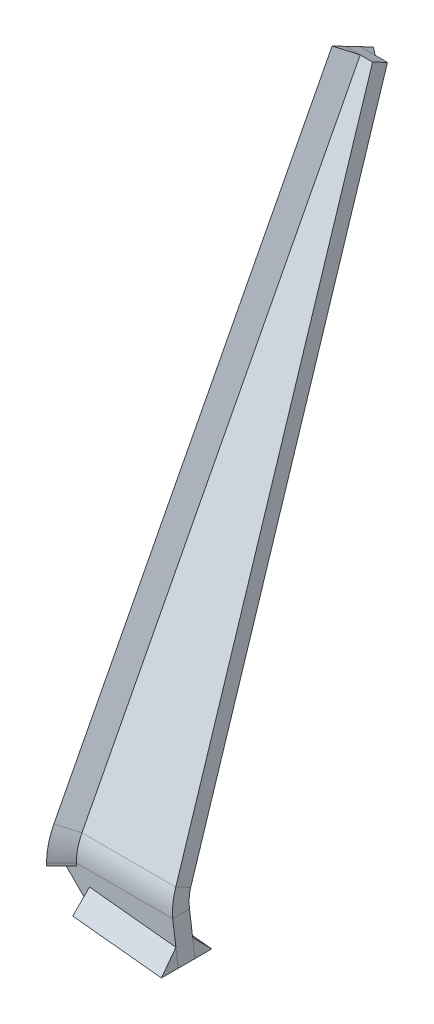
ISO-10303-21;
HEADER;
FILE_DESCRIPTION(('STEP AP214'),'2;1');
FILE_NAME('part.step','',(''),(''),'','','');
FILE_SCHEMA(('AUTOMOTIVE_DESIGN { 1 0 10303 214 1 1 1 1 }'));
ENDSEC;
DATA;
#1=APPLICATION_CONTEXT('core data for automotive mechanical design processes');
#2=APPLICATION_PROTOCOL_DEFINITION('international standard','automotive_design',2000,#1);
#3=PRODUCT_CONTEXT('',#1,'mechanical');
#4=PRODUCT('Part','Part','',(#3));
#5=PRODUCT_RELATED_PRODUCT_CATEGORY('part','',(#4));
#6=PRODUCT_DEFINITION_FORMATION('','',#4);
#7=PRODUCT_DEFINITION_CONTEXT('part definition',#1,'design');
#8=PRODUCT_DEFINITION('design','',#6,#7);
#9=PRODUCT_DEFINITION_SHAPE('','',#8);
#10=(LENGTH_UNIT() NAMED_UNIT(*) SI_UNIT(.MILLI.,.METRE.));
#11=(NAMED_UNIT(*) PLANE_ANGLE_UNIT() SI_UNIT($,.RADIAN.));
#12=(NAMED_UNIT(*) SI_UNIT($,.STERADIAN.) SOLID_ANGLE_UNIT());
#13=UNCERTAINTY_MEASURE_WITH_UNIT(LENGTH_MEASURE(1.E-05),#10,'distance_accuracy_value','');
#14=(GEOMETRIC_REPRESENTATION_CONTEXT(3) GLOBAL_UNCERTAINTY_ASSIGNED_CONTEXT((#13)) GLOBAL_UNIT_ASSIGNED_CONTEXT((#10,
#11,#12)) REPRESENTATION_CONTEXT('',''));
#15=CARTESIAN_POINT('',(0.,0.,0.));
#16=DIRECTION('',(0.,0.,1.));
#17=DIRECTION('',(1.,0.,0.));
#18=AXIS2_PLACEMENT_3D('',#15,#16,#17);
#19=CARTESIAN_POINT('',(3.54804333271288,6.67696676559556,4.00000000000001));
#20=DIRECTION('',(0.,0.,1.));
#21=DIRECTION('',(1.,0.,0.));
#22=AXIS2_PLACEMENT_3D('',#19,#20,#21);
#23=PLANE('',#22);
#24=DIRECTION('',(-1.,0.,0.));
#25=VECTOR('',#24,1.);
#26=CARTESIAN_POINT('',(3.54804333271288,6.67696676559556,4.00000000000001));
#27=LINE('',#26,#25);
#28=CARTESIAN_POINT('',(3.54804333271288,6.67696676559556,4.00000000000001));
#29=VERTEX_POINT('',#28);
#30=CARTESIAN_POINT('',(0.,6.67696676559556,4.00000000000001));
#31=VERTEX_POINT('',#30);
#32=EDGE_CURVE('E130',#29,#31,#27,.T.);
#33=ORIENTED_EDGE('',*,*,#32,.F.);
#34=DIRECTION('',(0.,-1.,0.));
#35=VECTOR('',#34,1.);
#36=CARTESIAN_POINT('',(3.54804333271288,6.67696676559556,4.00000000000001));
#37=LINE('',#36,#35);
#38=CARTESIAN_POINT('',(3.54804333271288,6.00000000000009,4.00000000000001));
#39=VERTEX_POINT('',#38);
#40=EDGE_CURVE('E73',#29,#39,#37,.T.);
#41=ORIENTED_EDGE('',*,*,#40,.T.);
#42=DIRECTION('',(-1.,0.,0.));
#43=VECTOR('',#42,1.);
#44=CARTESIAN_POINT('',(3.54804333271288,6.00000000000009,4.00000000000001));
#45=LINE('',#44,#43);
#46=CARTESIAN_POINT('',(0.,6.00000000000009,4.00000000000001));
#47=VERTEX_POINT('',#46);
#48=EDGE_CURVE('E80',#39,#47,#45,.T.);
#49=ORIENTED_EDGE('',*,*,#48,.T.);
#50=DIRECTION('',(0.,-1.,0.));
#51=VECTOR('',#50,1.);
#52=CARTESIAN_POINT('',(0.,6.67696676559556,4.00000000000001));
#53=LINE('',#52,#51);
#54=EDGE_CURVE('E13',#31,#47,#53,.T.);
#55=ORIENTED_EDGE('',*,*,#54,.F.);
#56=EDGE_LOOP('',(#33,#41,#49,#55));
#57=FACE_BOUND('',#56,.T.);
#58=ADVANCED_FACE('F66',(#57),#23,.F.);
#59=CARTESIAN_POINT('',(0.,6.67696676559555,7.5480433327129));
#60=DIRECTION('',(-0.707106781186548,0.,-0.707106781186547));
#61=DIRECTION('',(-0.707106781186547,0.,0.707106781186548));
#62=AXIS2_PLACEMENT_3D('',#59,#60,#61);
#63=PLANE('',#62);
#64=DIRECTION('',(0.707106781186547,0.,-0.707106781186548));
#65=VECTOR('',#64,1.);
#66=CARTESIAN_POINT('',(0.,6.67696676559555,7.5480433327129));
#67=LINE('',#66,#65);
#68=CARTESIAN_POINT('',(0.,6.67696676559555,7.5480433327129));
#69=VERTEX_POINT('',#68);
#70=EDGE_CURVE('E153',#69,#29,#67,.T.);
#71=ORIENTED_EDGE('',*,*,#70,.F.);
#72=DIRECTION('',(0.,-1.,0.));
#73=VECTOR('',#72,1.);
#74=CARTESIAN_POINT('',(0.,6.67696676559555,7.5480433327129));
#75=LINE('',#74,#73);
#76=CARTESIAN_POINT('',(0.,6.00000000000008,7.5480433327129));
#77=VERTEX_POINT('',#76);
#78=EDGE_CURVE('E125',#69,#77,#75,.T.);
#79=ORIENTED_EDGE('',*,*,#78,.T.);
#80=DIRECTION('',(0.707106781186547,0.,-0.707106781186548));
#81=VECTOR('',#80,1.);
#82=CARTESIAN_POINT('',(0.,6.00000000000008,7.5480433327129));
#83=LINE('',#82,#81);
#84=EDGE_CURVE('E88',#77,#39,#83,.T.);
#85=ORIENTED_EDGE('',*,*,#84,.T.);
#86=ORIENTED_EDGE('',*,*,#40,.F.);
#87=EDGE_LOOP('',(#71,#79,#85,#86));
#88=FACE_BOUND('',#87,.T.);
#89=ADVANCED_FACE('F166',(#88),#63,.F.);
#90=CARTESIAN_POINT('',(0.,6.67696676559554,-8.));
#91=DIRECTION('',(1.,0.,0.));
#92=DIRECTION('',(0.,1.,0.));
#93=AXIS2_PLACEMENT_3D('',#90,#91,#92);
#94=CYLINDRICAL_SURFACE('',#93,12.);
#95=DIRECTION('',(-1.,0.,0.));
#96=VECTOR('',#95,1.);
#97=CARTESIAN_POINT('',(3.54804333271288,12.217950124416,2.64412999813864));
#98=LINE('',#97,#96);
#99=CARTESIAN_POINT('',(3.54804333271288,12.217950124416,2.64412999813864));
#100=VERTEX_POINT('',#99);
#101=CARTESIAN_POINT('',(0.,12.217950124416,2.64412999813864));
#102=VERTEX_POINT('',#101);
#103=EDGE_CURVE('E138',#100,#102,#98,.T.);
#104=ORIENTED_EDGE('',*,*,#103,.F.);
#105=CARTESIAN_POINT('',(3.54804333271288,6.67696676559554,-8.));
#106=DIRECTION('',(1.,0.,0.));
#107=DIRECTION('',(0.,1.,0.));
#108=AXIS2_PLACEMENT_3D('',#105,#106,#107);
#109=CIRCLE('',#108,12.);
#110=EDGE_CURVE('E129',#100,#29,#109,.T.);
#111=ORIENTED_EDGE('',*,*,#110,.T.);
#112=ORIENTED_EDGE('',*,*,#32,.T.);
#113=CARTESIAN_POINT('',(0.,6.67696676559554,-8.));
#114=DIRECTION('',(1.,0.,0.));
#115=DIRECTION('',(0.,1.,0.));
#116=AXIS2_PLACEMENT_3D('',#113,#114,#115);
#117=CIRCLE('',#116,12.);
#118=EDGE_CURVE('E158',#102,#31,#117,.T.);
#119=ORIENTED_EDGE('',*,*,#118,.F.);
#120=EDGE_LOOP('',(#104,#111,#112,#119));
#121=FACE_BOUND('',#120,.T.);
#122=ADVANCED_FACE('F168',(#121),#94,.F.);
#123=CARTESIAN_POINT('',(0.,6.67696676559554,-8.));
#124=DIRECTION('',(-1.,0.,0.));
#125=DIRECTION('',(0.,-1.,0.));
#126=AXIS2_PLACEMENT_3D('',#123,#124,#125);
#127=CONICAL_SURFACE('',#126,15.5480433327129,0.785398163397448);
#128=DIRECTION('',(0.707106781186547,-0.326505575621977,-0.62721137512625));
#129=VECTOR('',#128,1.);
#130=CARTESIAN_POINT('',(0.,13.856254212994,5.79128287084073));
#131=LINE('',#130,#129);
#132=CARTESIAN_POINT('',(0.,13.856254212994,5.79128287084073));
#133=VERTEX_POINT('',#132);
#134=EDGE_CURVE('E133',#133,#100,#131,.T.);
#135=ORIENTED_EDGE('',*,*,#134,.F.);
#136=CARTESIAN_POINT('',(0.,6.67696676559554,-8.));
#137=DIRECTION('',(1.,0.,0.));
#138=DIRECTION('',(0.,1.,0.));
#139=AXIS2_PLACEMENT_3D('',#136,#137,#138);
#140=CIRCLE('',#139,15.5480433327129);
#141=EDGE_CURVE('E118',#133,#69,#140,.T.);
#142=ORIENTED_EDGE('',*,*,#141,.T.);
#143=ORIENTED_EDGE('',*,*,#70,.T.);
#144=ORIENTED_EDGE('',*,*,#110,.F.);
#145=EDGE_LOOP('',(#135,#142,#143,#144));
#146=FACE_BOUND('',#145,.T.);
#147=ADVANCED_FACE('F134',(#146),#127,.T.);
#148=CARTESIAN_POINT('',(0.,12.217950124416,2.64412999813864));
#149=DIRECTION('',(-1.,0.,0.));
#150=DIRECTION('',(0.,0.,1.));
#151=AXIS2_PLACEMENT_3D('',#148,#149,#150);
#152=PLANE('',#151);
#153=DIRECTION('',(0.,0.461748613235034,0.887010833178221));
#154=VECTOR('',#153,1.);
#155=CARTESIAN_POINT('',(0.,139.660976123687,-63.6985101596913));
#156=LINE('',#155,#154);
#157=CARTESIAN_POINT('',(0.,139.660976123687,-63.6985101596913));
#158=VERTEX_POINT('',#157);
#159=CARTESIAN_POINT('',(0.,141.299280212264,-60.5513572869892));
#160=VERTEX_POINT('',#159);
#161=EDGE_CURVE('E177',#158,#160,#156,.T.);
#162=ORIENTED_EDGE('',*,*,#161,.F.);
#163=DIRECTION('',(0.,0.887010833178221,-0.461748613235035));
#164=VECTOR('',#163,1.);
#165=CARTESIAN_POINT('',(0.,12.217950124416,2.64412999813864));
#166=LINE('',#165,#164);
#167=EDGE_CURVE('E147',#102,#158,#166,.T.);
#168=ORIENTED_EDGE('',*,*,#167,.F.);
#169=ORIENTED_EDGE('',*,*,#118,.T.);
#170=ORIENTED_EDGE('',*,*,#54,.T.);
#171=DIRECTION('',(0.,0.,1.));
#172=VECTOR('',#171,1.);
#173=CARTESIAN_POINT('',(0.,6.00000000000009,4.00000000000001));
#174=LINE('',#173,#172);
#175=EDGE_CURVE('E161',#47,#77,#174,.T.);
#176=ORIENTED_EDGE('',*,*,#175,.T.);
#177=ORIENTED_EDGE('',*,*,#78,.F.);
#178=ORIENTED_EDGE('',*,*,#141,.F.);
#179=DIRECTION('',(0.,0.887010833178221,-0.461748613235035));
#180=VECTOR('',#179,1.);
#181=CARTESIAN_POINT('',(0.,13.856254212994,5.79128287084073));
#182=LINE('',#181,#180);
#183=EDGE_CURVE('E123',#133,#160,#182,.T.);
#184=ORIENTED_EDGE('',*,*,#183,.T.);
#185=EDGE_LOOP('',(#162,#168,#169,#170,#176,#177,#178,#184));
#186=FACE_BOUND('',#185,.T.);
#187=ADVANCED_FACE('F121',(#186),#152,.T.);
#188=CARTESIAN_POINT('',(3.54804333271288,12.217950124416,2.64412999813864));
#189=DIRECTION('',(0.,-0.461748613235035,-0.887010833178221));
#190=DIRECTION('',(0.,0.887010833178221,-0.461748613235035));
#191=AXIS2_PLACEMENT_3D('',#188,#189,#190);
#192=PLANE('',#191);
#193=DIRECTION('',(-1.,0.,0.));
#194=VECTOR('',#193,1.);
#195=CARTESIAN_POINT('',(3.54804333271288,139.660976123687,-63.6985101596913));
#196=LINE('',#195,#194);
#197=CARTESIAN_POINT('',(3.54804333271288,139.660976123687,-63.6985101596913));
#198=VERTEX_POINT('',#197);
#199=EDGE_CURVE('E139',#198,#158,#196,.T.);
#200=ORIENTED_EDGE('',*,*,#199,.F.);
#201=DIRECTION('',(0.,0.887010833178221,-0.461748613235035));
#202=VECTOR('',#201,1.);
#203=CARTESIAN_POINT('',(3.54804333271288,12.217950124416,2.64412999813864));
#204=LINE('',#203,#202);
#205=EDGE_CURVE('E145',#100,#198,#204,.T.);
#206=ORIENTED_EDGE('',*,*,#205,.F.);
#207=ORIENTED_EDGE('',*,*,#103,.T.);
#208=ORIENTED_EDGE('',*,*,#167,.T.);
#209=EDGE_LOOP('',(#200,#206,#207,#208));
#210=FACE_BOUND('',#209,.T.);
#211=ADVANCED_FACE('F173',(#210),#192,.T.);
#212=CARTESIAN_POINT('',(0.,13.856254212994,5.79128287084073));
#213=DIRECTION('',(0.707106781186548,0.326505575621977,0.627211375126249));
#214=DIRECTION('',(0.663578618400424,0.,-0.748106554711148));
#215=AXIS2_PLACEMENT_3D('',#212,#213,#214);
#216=PLANE('',#215);
#217=DIRECTION('',(0.707106781186547,-0.326505575621977,-0.62721137512625));
#218=VECTOR('',#217,1.);
#219=CARTESIAN_POINT('',(0.,141.299280212264,-60.5513572869892));
#220=LINE('',#219,#218);
#221=EDGE_CURVE('E143',#160,#198,#220,.T.);
#222=ORIENTED_EDGE('',*,*,#221,.F.);
#223=ORIENTED_EDGE('',*,*,#183,.F.);
#224=ORIENTED_EDGE('',*,*,#134,.T.);
#225=ORIENTED_EDGE('',*,*,#205,.T.);
#226=EDGE_LOOP('',(#222,#223,#224,#225));
#227=FACE_BOUND('',#226,.T.);
#228=ADVANCED_FACE('F141',(#227),#216,.T.);
#229=CARTESIAN_POINT('',(0.,6.00000000000009,4.00000000000001));
#230=DIRECTION('',(0.,-1.,0.));
#231=DIRECTION('',(0.,0.,-1.));
#232=AXIS2_PLACEMENT_3D('',#229,#230,#231);
#233=PLANE('',#232);
#234=ORIENTED_EDGE('',*,*,#175,.F.);
#235=ORIENTED_EDGE('',*,*,#48,.F.);
#236=ORIENTED_EDGE('',*,*,#84,.F.);
#237=EDGE_LOOP('',(#234,#235,#236));
#238=FACE_BOUND('',#237,.T.);
#239=ADVANCED_FACE('F182',(#238),#233,.T.);
#240=CARTESIAN_POINT('',(0.,139.660976123687,-63.6985101596913));
#241=DIRECTION('',(0.,-0.887010833178221,0.461748613235034));
#242=DIRECTION('',(0.,-0.461748613235034,-0.887010833178221));
#243=AXIS2_PLACEMENT_3D('',#240,#241,#242);
#244=PLANE('',#243);
#245=ORIENTED_EDGE('',*,*,#161,.T.);
#246=ORIENTED_EDGE('',*,*,#221,.T.);
#247=ORIENTED_EDGE('',*,*,#199,.T.);
#248=EDGE_LOOP('',(#245,#246,#247));
#249=FACE_BOUND('',#248,.T.);
#250=ADVANCED_FACE('F176',(#249),#244,.F.);
#251=CLOSED_SHELL('',(#58,#89,#122,#147,#187,#211,#228,#239,#250));
#252=MANIFOLD_SOLID_BREP('B2',#251);
#253=CARTESIAN_POINT('',(3.54804333271288,6.67696676559557,0.));
#254=DIRECTION('',(0.,0.,-1.));
#255=DIRECTION('',(-1.,0.,0.));
#256=AXIS2_PLACEMENT_3D('',#253,#254,#255);
#257=PLANE('',#256);
#258=DIRECTION('',(1.,0.,0.));
#259=VECTOR('',#258,1.);
#260=CARTESIAN_POINT('',(3.54804333271288,6.67696676559557,0.));
#261=LINE('',#260,#259);
#262=CARTESIAN_POINT('',(0.,6.67696676559557,0.));
#263=VERTEX_POINT('',#262);
#264=CARTESIAN_POINT('',(3.54804333271288,6.67696676559557,0.));
#265=VERTEX_POINT('',#264);
#266=EDGE_CURVE('E337',#263,#265,#261,.T.);
#267=ORIENTED_EDGE('',*,*,#266,.F.);
#268=DIRECTION('',(0.,-1.,0.));
#269=VECTOR('',#268,1.);
#270=CARTESIAN_POINT('',(0.,6.67696676559557,0.));
#271=LINE('',#270,#269);
#272=CARTESIAN_POINT('',(0.,6.0000000000001,0.));
#273=VERTEX_POINT('',#272);
#274=EDGE_CURVE('E280',#263,#273,#271,.T.);
#275=ORIENTED_EDGE('',*,*,#274,.T.);
#276=DIRECTION('',(1.,0.,0.));
#277=VECTOR('',#276,1.);
#278=CARTESIAN_POINT('',(3.54804333271288,6.0000000000001,0.));
#279=LINE('',#278,#277);
#280=CARTESIAN_POINT('',(3.54804333271288,6.0000000000001,0.));
#281=VERTEX_POINT('',#280);
#282=EDGE_CURVE('E287',#273,#281,#279,.T.);
#283=ORIENTED_EDGE('',*,*,#282,.T.);
#284=DIRECTION('',(0.,-1.,0.));
#285=VECTOR('',#284,1.);
#286=CARTESIAN_POINT('',(3.54804333271288,6.67696676559557,0.));
#287=LINE('',#286,#285);
#288=EDGE_CURVE('E64',#265,#281,#287,.T.);
#289=ORIENTED_EDGE('',*,*,#288,.F.);
#290=EDGE_LOOP('',(#267,#275,#283,#289));
#291=FACE_BOUND('',#290,.T.);
#292=ADVANCED_FACE('F273',(#291),#257,.F.);
#293=CARTESIAN_POINT('',(0.,6.67696676559558,-3.5480433327129));
#294=DIRECTION('',(-0.707106781186548,0.,0.707106781186547));
#295=DIRECTION('',(0.707106781186547,0.,0.707106781186548));
#296=AXIS2_PLACEMENT_3D('',#293,#294,#295);
#297=PLANE('',#296);
#298=DIRECTION('',(-0.707106781186547,0.,-0.707106781186548));
#299=VECTOR('',#298,1.);
#300=CARTESIAN_POINT('',(0.,6.67696676559558,-3.5480433327129));
#301=LINE('',#300,#299);
#302=CARTESIAN_POINT('',(0.,6.67696676559558,-3.5480433327129));
#303=VERTEX_POINT('',#302);
#304=EDGE_CURVE('E335',#265,#303,#301,.T.);
#305=ORIENTED_EDGE('',*,*,#304,.F.);
#306=ORIENTED_EDGE('',*,*,#288,.T.);
#307=DIRECTION('',(-0.707106781186547,0.,-0.707106781186548));
#308=VECTOR('',#307,1.);
#309=CARTESIAN_POINT('',(0.,6.00000000000011,-3.5480433327129));
#310=LINE('',#309,#308);
#311=CARTESIAN_POINT('',(0.,6.00000000000011,-3.5480433327129));
#312=VERTEX_POINT('',#311);
#313=EDGE_CURVE('E371',#281,#312,#310,.T.);
#314=ORIENTED_EDGE('',*,*,#313,.T.);
#315=DIRECTION('',(0.,-1.,0.));
#316=VECTOR('',#315,1.);
#317=CARTESIAN_POINT('',(0.,6.67696676559558,-3.5480433327129));
#318=LINE('',#317,#316);
#319=EDGE_CURVE('E375',#303,#312,#318,.T.);
#320=ORIENTED_EDGE('',*,*,#319,.F.);
#321=EDGE_LOOP('',(#305,#306,#314,#320));
#322=FACE_BOUND('',#321,.T.);
#323=ADVANCED_FACE('F396',(#322),#297,.F.);
#324=CARTESIAN_POINT('',(0.,6.67696676559554,-8.));
#325=DIRECTION('',(1.,0.,0.));
#326=DIRECTION('',(0.,1.,0.));
#327=AXIS2_PLACEMENT_3D('',#324,#325,#326);
#328=CYLINDRICAL_SURFACE('',#327,7.99999999999999);
#329=DIRECTION('',(1.,0.,0.));
#330=VECTOR('',#329,1.);
#331=CARTESIAN_POINT('',(3.54804333271288,10.3709556714759,-0.903913334574263));
#332=LINE('',#331,#330);
#333=CARTESIAN_POINT('',(0.,10.3709556714759,-0.903913334574263));
#334=VERTEX_POINT('',#333);
#335=CARTESIAN_POINT('',(3.54804333271288,10.3709556714759,-0.903913334574263));
#336=VERTEX_POINT('',#335);
#337=EDGE_CURVE('E348',#334,#336,#332,.T.);
#338=ORIENTED_EDGE('',*,*,#337,.F.);
#339=CARTESIAN_POINT('',(0.,6.67696676559554,-8.));
#340=DIRECTION('',(1.,0.,0.));
#341=DIRECTION('',(0.,1.,0.));
#342=AXIS2_PLACEMENT_3D('',#339,#340,#341);
#343=CIRCLE('',#342,7.99999999999999);
#344=EDGE_CURVE('E336',#334,#263,#343,.T.);
#345=ORIENTED_EDGE('',*,*,#344,.T.);
#346=ORIENTED_EDGE('',*,*,#266,.T.);
#347=CARTESIAN_POINT('',(3.54804333271288,6.67696676559554,-8.));
#348=DIRECTION('',(1.,0.,0.));
#349=DIRECTION('',(0.,1.,0.));
#350=AXIS2_PLACEMENT_3D('',#347,#348,#349);
#351=CIRCLE('',#350,7.99999999999999);
#352=EDGE_CURVE('E369',#336,#265,#351,.T.);
#353=ORIENTED_EDGE('',*,*,#352,.F.);
#354=EDGE_LOOP('',(#338,#345,#346,#353));
#355=FACE_BOUND('',#354,.T.);
#356=ADVANCED_FACE('F380',(#355),#328,.T.);
#357=CARTESIAN_POINT('',(3.54804333271288,6.67696676559554,-8.));
#358=DIRECTION('',(1.,0.,0.));
#359=DIRECTION('',(0.,1.,0.));
#360=AXIS2_PLACEMENT_3D('',#357,#358,#359);
#361=CONICAL_SURFACE('',#360,7.99999999999999,0.785398163397449);
#362=DIRECTION('',(-0.707106781186547,-0.326505575621977,-0.62721137512625));
#363=VECTOR('',#362,1.);
#364=CARTESIAN_POINT('',(0.,8.73265158289788,-4.05106620727635));
#365=LINE('',#364,#363);
#366=CARTESIAN_POINT('',(0.,8.73265158289788,-4.05106620727635));
#367=VERTEX_POINT('',#366);
#368=EDGE_CURVE('E332',#336,#367,#365,.T.);
#369=ORIENTED_EDGE('',*,*,#368,.F.);
#370=ORIENTED_EDGE('',*,*,#352,.T.);
#371=ORIENTED_EDGE('',*,*,#304,.T.);
#372=CARTESIAN_POINT('',(0.,6.67696676559554,-8.));
#373=DIRECTION('',(1.,0.,0.));
#374=DIRECTION('',(0.,1.,0.));
#375=AXIS2_PLACEMENT_3D('',#372,#373,#374);
#376=CIRCLE('',#375,4.4519566672871);
#377=EDGE_CURVE('E327',#367,#303,#376,.T.);
#378=ORIENTED_EDGE('',*,*,#377,.F.);
#379=EDGE_LOOP('',(#369,#370,#371,#378));
#380=FACE_BOUND('',#379,.T.);
#381=ADVANCED_FACE('F329',(#380),#361,.F.);
#382=CARTESIAN_POINT('',(0.,8.73265158289788,-4.05106620727635));
#383=DIRECTION('',(0.707106781186548,-0.326505575621977,-0.627211375126249));
#384=DIRECTION('',(-0.663578618400424,0.,-0.748106554711148));
#385=AXIS2_PLACEMENT_3D('',#382,#383,#384);
#386=PLANE('',#385);
#387=DIRECTION('',(-0.707106781186547,-0.326505575621977,-0.62721137512625));
#388=VECTOR('',#387,1.);
#389=CARTESIAN_POINT('',(0.,136.175677582168,-70.3937063651063));
#390=LINE('',#389,#388);
#391=CARTESIAN_POINT('',(3.54804333271288,137.813981670746,-67.2465534924042));
#392=VERTEX_POINT('',#391);
#393=CARTESIAN_POINT('',(0.,136.175677582168,-70.3937063651063));
#394=VERTEX_POINT('',#393);
#395=EDGE_CURVE('E359',#392,#394,#390,.T.);
#396=ORIENTED_EDGE('',*,*,#395,.F.);
#397=DIRECTION('',(0.,0.887010833178221,-0.461748613235035));
#398=VECTOR('',#397,1.);
#399=CARTESIAN_POINT('',(3.54804333271288,10.3709556714759,-0.903913334574263));
#400=LINE('',#399,#398);
#401=EDGE_CURVE('E351',#336,#392,#400,.T.);
#402=ORIENTED_EDGE('',*,*,#401,.F.);
#403=ORIENTED_EDGE('',*,*,#368,.T.);
#404=DIRECTION('',(0.,0.887010833178221,-0.461748613235035));
#405=VECTOR('',#404,1.);
#406=CARTESIAN_POINT('',(0.,8.73265158289788,-4.05106620727635));
#407=LINE('',#406,#405);
#408=EDGE_CURVE('E340',#367,#394,#407,.T.);
#409=ORIENTED_EDGE('',*,*,#408,.T.);
#410=EDGE_LOOP('',(#396,#402,#403,#409));
#411=FACE_BOUND('',#410,.T.);
#412=ADVANCED_FACE('F350',(#411),#386,.T.);
#413=CARTESIAN_POINT('',(3.54804333271288,10.3709556714759,-0.903913334574263));
#414=DIRECTION('',(0.,0.461748613235035,0.887010833178221));
#415=DIRECTION('',(0.,-0.887010833178221,0.461748613235035));
#416=AXIS2_PLACEMENT_3D('',#413,#414,#415);
#417=PLANE('',#416);
#418=DIRECTION('',(1.,0.,0.));
#419=VECTOR('',#418,1.);
#420=CARTESIAN_POINT('',(3.54804333271288,137.813981670746,-67.2465534924042));
#421=LINE('',#420,#419);
#422=CARTESIAN_POINT('',(0.,137.813981670746,-67.2465534924042));
#423=VERTEX_POINT('',#422);
#424=EDGE_CURVE('E353',#423,#392,#421,.T.);
#425=ORIENTED_EDGE('',*,*,#424,.F.);
#426=DIRECTION('',(0.,0.887010833178221,-0.461748613235035));
#427=VECTOR('',#426,1.);
#428=CARTESIAN_POINT('',(0.,10.3709556714759,-0.903913334574263));
#429=LINE('',#428,#427);
#430=EDGE_CURVE('E347',#334,#423,#429,.T.);
#431=ORIENTED_EDGE('',*,*,#430,.F.);
#432=ORIENTED_EDGE('',*,*,#337,.T.);
#433=ORIENTED_EDGE('',*,*,#401,.T.);
#434=EDGE_LOOP('',(#425,#431,#432,#433));
#435=FACE_BOUND('',#434,.T.);
#436=ADVANCED_FACE('F383',(#435),#417,.T.);
#437=CARTESIAN_POINT('',(0.,10.3709556714759,-0.903913334574263));
#438=DIRECTION('',(-1.,0.,0.));
#439=DIRECTION('',(0.,-1.,0.));
#440=AXIS2_PLACEMENT_3D('',#437,#438,#439);
#441=PLANE('',#440);
#442=DIRECTION('',(0.,0.461748613235034,0.887010833178221));
#443=VECTOR('',#442,1.);
#444=CARTESIAN_POINT('',(0.,137.813981670746,-67.2465534924042));
#445=LINE('',#444,#443);
#446=EDGE_CURVE('E343',#394,#423,#445,.T.);
#447=ORIENTED_EDGE('',*,*,#446,.F.);
#448=ORIENTED_EDGE('',*,*,#408,.F.);
#449=ORIENTED_EDGE('',*,*,#377,.T.);
#450=ORIENTED_EDGE('',*,*,#319,.T.);
#451=DIRECTION('',(0.,0.,1.));
#452=VECTOR('',#451,1.);
#453=CARTESIAN_POINT('',(0.,6.0000000000001,0.));
#454=LINE('',#453,#452);
#455=EDGE_CURVE('E295',#312,#273,#454,.T.);
#456=ORIENTED_EDGE('',*,*,#455,.T.);
#457=ORIENTED_EDGE('',*,*,#274,.F.);
#458=ORIENTED_EDGE('',*,*,#344,.F.);
#459=ORIENTED_EDGE('',*,*,#430,.T.);
#460=EDGE_LOOP('',(#447,#448,#449,#450,#456,#457,#458,#459));
#461=FACE_BOUND('',#460,.T.);
#462=ADVANCED_FACE('F341',(#461),#441,.T.);
#463=CARTESIAN_POINT('',(3.54804333271288,6.0000000000001,0.));
#464=DIRECTION('',(0.,-1.,0.));
#465=DIRECTION('',(0.,0.,-1.));
#466=AXIS2_PLACEMENT_3D('',#463,#464,#465);
#467=PLANE('',#466);
#468=ORIENTED_EDGE('',*,*,#313,.F.);
#469=ORIENTED_EDGE('',*,*,#282,.F.);
#470=ORIENTED_EDGE('',*,*,#455,.F.);
#471=EDGE_LOOP('',(#468,#469,#470));
#472=FACE_BOUND('',#471,.T.);
#473=ADVANCED_FACE('F387',(#472),#467,.T.);
#474=CARTESIAN_POINT('',(3.54804333271288,137.813981670746,-67.2465534924042));
#475=DIRECTION('',(0.,-0.887010833178221,0.461748613235034));
#476=DIRECTION('',(0.,-0.461748613235034,-0.887010833178221));
#477=AXIS2_PLACEMENT_3D('',#474,#475,#476);
#478=PLANE('',#477);
#479=ORIENTED_EDGE('',*,*,#395,.T.);
#480=ORIENTED_EDGE('',*,*,#446,.T.);
#481=ORIENTED_EDGE('',*,*,#424,.T.);
#482=EDGE_LOOP('',(#479,#480,#481));
#483=FACE_BOUND('',#482,.T.);
#484=ADVANCED_FACE('F385',(#483),#478,.F.);
#485=CLOSED_SHELL('',(#292,#323,#356,#381,#412,#436,#462,#473,#484));
#486=MANIFOLD_SOLID_BREP('B7',#485);
#487=CARTESIAN_POINT('',(6.70469146960512,-0.704691469605121,4.));
#488=DIRECTION('',(-1.,0.,0.));
#489=DIRECTION('',(0.,0.,1.));
#490=AXIS2_PLACEMENT_3D('',#487,#488,#489);
#491=PLANE('',#490);
#492=DIRECTION('',(0.,1.,0.));
#493=VECTOR('',#492,1.);
#494=CARTESIAN_POINT('',(6.70469146960512,3.29530853039488,4.));
#495=LINE('',#494,#493);
#496=CARTESIAN_POINT('',(6.70469146960512,-0.704691469605121,4.));
#497=VERTEX_POINT('',#496);
#498=CARTESIAN_POINT('',(6.70469146960512,3.29530853039488,4.));
#499=VERTEX_POINT('',#498);
#500=EDGE_CURVE('E522',#497,#499,#495,.T.);
#501=ORIENTED_EDGE('',*,*,#500,.F.);
#502=DIRECTION('',(0.,0.,-1.));
#503=VECTOR('',#502,1.);
#504=CARTESIAN_POINT('',(6.70469146960512,-0.704691469605121,4.));
#505=LINE('',#504,#503);
#506=CARTESIAN_POINT('',(6.70469146960512,-0.704691469605122,8.));
#507=VERTEX_POINT('',#506);
#508=EDGE_CURVE('E524',#507,#497,#505,.T.);
#509=ORIENTED_EDGE('',*,*,#508,.F.);
#510=DIRECTION('',(0.,-0.707106781186548,0.707106781186547));
#511=VECTOR('',#510,1.);
#512=CARTESIAN_POINT('',(6.70469146960512,3.29530853039488,4.));
#513=LINE('',#512,#511);
#514=EDGE_CURVE('E515',#499,#507,#513,.T.);
#515=ORIENTED_EDGE('',*,*,#514,.F.);
#516=EDGE_LOOP('',(#501,#509,#515));
#517=FACE_BOUND('',#516,.T.);
#518=ADVANCED_FACE('F480',(#517),#491,.T.);
#519=CARTESIAN_POINT('',(33.2805950239565,-3.49793148917952,4.));
#520=DIRECTION('',(0.104528463267651,0.994521895368274,0.));
#521=DIRECTION('',(-0.994521895368274,0.104528463267651,0.));
#522=AXIS2_PLACEMENT_3D('',#519,#520,#521);
#523=PLANE('',#522);
#524=DIRECTION('',(-0.994521895368274,0.104528463267651,0.));
#525=VECTOR('',#524,1.);
#526=CARTESIAN_POINT('',(33.2805950239565,-3.49793148917952,4.));
#527=LINE('',#526,#525);
#528=CARTESIAN_POINT('',(27.8466130703117,-2.92679697149421,4.));
#529=VERTEX_POINT('',#528);
#530=EDGE_CURVE('E527',#529,#497,#527,.T.);
#531=ORIENTED_EDGE('',*,*,#530,.F.);
#532=DIRECTION('',(0.,0.,1.));
#533=VECTOR('',#532,1.);
#534=CARTESIAN_POINT('',(27.8466130703117,-2.92679697149421,4.));
#535=LINE('',#534,#533);
#536=CARTESIAN_POINT('',(27.8466130703117,-2.92679697149421,8.));
#537=VERTEX_POINT('',#536);
#538=EDGE_CURVE('E484',#529,#537,#535,.T.);
#539=ORIENTED_EDGE('',*,*,#538,.T.);
#540=DIRECTION('',(-0.994521895368274,0.104528463267651,0.));
#541=VECTOR('',#540,1.);
#542=CARTESIAN_POINT('',(33.2805950239565,-3.49793148917952,8.));
#543=LINE('',#542,#541);
#544=EDGE_CURVE('E519',#537,#507,#543,.T.);
#545=ORIENTED_EDGE('',*,*,#544,.T.);
#546=ORIENTED_EDGE('',*,*,#508,.T.);
#547=EDGE_LOOP('',(#531,#539,#545,#546));
#548=FACE_BOUND('',#547,.T.);
#549=ADVANCED_FACE('F535',(#548),#523,.F.);
#550=CARTESIAN_POINT('',(33.2805950239565,0.502068510820482,4.));
#551=DIRECTION('',(-0.0741155126847491,-0.70516199939428,-0.70516199939428));
#552=DIRECTION('',(0.,0.707106781186548,-0.707106781186547));
#553=AXIS2_PLACEMENT_3D('',#550,#551,#552);
#554=PLANE('',#553);
#555=ORIENTED_EDGE('',*,*,#544,.F.);
#556=DIRECTION('',(-0.0958164778483682,0.708870741875587,-0.698800024245483));
#557=VECTOR('',#556,1.);
#558=CARTESIAN_POINT('',(27.3957814505822,0.408551518817847,4.71203582231319));
#559=LINE('',#558,#557);
#560=CARTESIAN_POINT('',(27.2981501365742,1.13084880572784,4.));
#561=VERTEX_POINT('',#560);
#562=EDGE_CURVE('E490',#537,#561,#559,.T.);
#563=ORIENTED_EDGE('',*,*,#562,.T.);
#564=DIRECTION('',(-0.994521895368274,0.104528463267651,0.));
#565=VECTOR('',#564,1.);
#566=CARTESIAN_POINT('',(33.2805950239565,0.502068510820482,4.));
#567=LINE('',#566,#565);
#568=EDGE_CURVE('E511',#561,#499,#567,.T.);
#569=ORIENTED_EDGE('',*,*,#568,.T.);
#570=ORIENTED_EDGE('',*,*,#514,.T.);
#571=EDGE_LOOP('',(#555,#563,#569,#570));
#572=FACE_BOUND('',#571,.T.);
#573=ADVANCED_FACE('F514',(#572),#554,.F.);
#574=CARTESIAN_POINT('',(33.2805950239565,0.502068510820482,4.));
#575=DIRECTION('',(0.,0.,1.));
#576=DIRECTION('',(0.,-1.,0.));
#577=AXIS2_PLACEMENT_3D('',#574,#575,#576);
#578=PLANE('',#577);
#579=ORIENTED_EDGE('',*,*,#568,.F.);
#580=DIRECTION('',(0.133949657316128,-0.990988137822493,0.));
#581=VECTOR('',#580,1.);
#582=CARTESIAN_POINT('',(27.4889560997429,-0.280774410893808,4.));
#583=LINE('',#582,#581);
#584=EDGE_CURVE('E271',#561,#529,#583,.T.);
#585=ORIENTED_EDGE('',*,*,#584,.T.);
#586=ORIENTED_EDGE('',*,*,#530,.T.);
#587=ORIENTED_EDGE('',*,*,#500,.T.);
#588=EDGE_LOOP('',(#579,#585,#586,#587));
#589=FACE_BOUND('',#588,.T.);
#590=ADVANCED_FACE('F482',(#589),#578,.F.);
#591=CARTESIAN_POINT('',(27.8466130703117,-2.92679697149421,4.));
#592=DIRECTION('',(-0.990988137822493,-0.133949657316128,0.));
#593=DIRECTION('',(0.133949657316128,-0.990988137822493,0.));
#594=AXIS2_PLACEMENT_3D('',#591,#592,#593);
#595=PLANE('',#594);
#596=ORIENTED_EDGE('',*,*,#562,.F.);
#597=ORIENTED_EDGE('',*,*,#538,.F.);
#598=ORIENTED_EDGE('',*,*,#584,.F.);
#599=EDGE_LOOP('',(#596,#597,#598));
#600=FACE_BOUND('',#599,.T.);
#601=ADVANCED_FACE('F536',(#600),#595,.F.);
#602=CLOSED_SHELL('',(#518,#549,#573,#590,#601));
#603=MANIFOLD_SOLID_BREP('B58',#602);
#604=CARTESIAN_POINT('',(6.70469146960512,-0.70469146960512,-4.));
#605=DIRECTION('',(1.,0.,0.));
#606=DIRECTION('',(0.,0.,-1.));
#607=AXIS2_PLACEMENT_3D('',#604,#605,#606);
#608=PLANE('',#607);
#609=DIRECTION('',(0.,0.707106781186547,0.707106781186548));
#610=VECTOR('',#609,1.);
#611=CARTESIAN_POINT('',(6.70469146960512,3.29530853039488,0.));
#612=LINE('',#611,#610);
#613=CARTESIAN_POINT('',(6.70469146960512,-0.70469146960512,-4.));
#614=VERTEX_POINT('',#613);
#615=CARTESIAN_POINT('',(6.70469146960512,3.29530853039488,0.));
#616=VERTEX_POINT('',#615);
#617=EDGE_CURVE('E629',#614,#616,#612,.T.);
#618=ORIENTED_EDGE('',*,*,#617,.F.);
#619=DIRECTION('',(0.,0.,-1.));
#620=VECTOR('',#619,1.);
#621=CARTESIAN_POINT('',(6.70469146960512,-0.70469146960512,0.));
#622=LINE('',#621,#620);
#623=CARTESIAN_POINT('',(6.70469146960512,-0.70469146960512,0.));
#624=VERTEX_POINT('',#623);
#625=EDGE_CURVE('E631',#624,#614,#622,.T.);
#626=ORIENTED_EDGE('',*,*,#625,.F.);
#627=DIRECTION('',(0.,-1.,0.));
#628=VECTOR('',#627,1.);
#629=CARTESIAN_POINT('',(6.70469146960512,3.29530853039488,0.));
#630=LINE('',#629,#628);
#631=EDGE_CURVE('E622',#616,#624,#630,.T.);
#632=ORIENTED_EDGE('',*,*,#631,.F.);
#633=EDGE_LOOP('',(#618,#626,#632));
#634=FACE_BOUND('',#633,.T.);
#635=ADVANCED_FACE('F587',(#634),#608,.F.);
#636=CARTESIAN_POINT('',(33.2805950239565,-3.49793148917952,0.));
#637=DIRECTION('',(0.104528463267651,0.994521895368274,0.));
#638=DIRECTION('',(-0.994521895368274,0.104528463267651,0.));
#639=AXIS2_PLACEMENT_3D('',#636,#637,#638);
#640=PLANE('',#639);
#641=DIRECTION('',(-0.994521895368274,0.104528463267651,0.));
#642=VECTOR('',#641,1.);
#643=CARTESIAN_POINT('',(33.2805950239565,-3.49793148917952,-4.));
#644=LINE('',#643,#642);
#645=CARTESIAN_POINT('',(27.8466130703117,-2.92679697149421,-4.));
#646=VERTEX_POINT('',#645);
#647=EDGE_CURVE('E634',#646,#614,#644,.T.);
#648=ORIENTED_EDGE('',*,*,#647,.F.);
#649=DIRECTION('',(0.,0.,1.));
#650=VECTOR('',#649,1.);
#651=CARTESIAN_POINT('',(27.8466130703117,-2.92679697149421,0.));
#652=LINE('',#651,#650);
#653=CARTESIAN_POINT('',(27.8466130703117,-2.92679697149421,0.));
#654=VERTEX_POINT('',#653);
#655=EDGE_CURVE('E591',#646,#654,#652,.T.);
#656=ORIENTED_EDGE('',*,*,#655,.T.);
#657=DIRECTION('',(-0.994521895368274,0.104528463267651,0.));
#658=VECTOR('',#657,1.);
#659=CARTESIAN_POINT('',(33.2805950239565,-3.49793148917952,0.));
#660=LINE('',#659,#658);
#661=EDGE_CURVE('E626',#654,#624,#660,.T.);
#662=ORIENTED_EDGE('',*,*,#661,.T.);
#663=ORIENTED_EDGE('',*,*,#625,.T.);
#664=EDGE_LOOP('',(#648,#656,#662,#663));
#665=FACE_BOUND('',#664,.T.);
#666=ADVANCED_FACE('F642',(#665),#640,.F.);
#667=CARTESIAN_POINT('',(33.2805950239565,0.502068510820482,0.));
#668=DIRECTION('',(0.,0.,-1.));
#669=DIRECTION('',(0.,1.,0.));
#670=AXIS2_PLACEMENT_3D('',#667,#668,#669);
#671=PLANE('',#670);
#672=ORIENTED_EDGE('',*,*,#661,.F.);
#673=DIRECTION('',(-0.133949657316128,0.990988137822493,0.));
#674=VECTOR('',#673,1.);
#675=CARTESIAN_POINT('',(27.4889560997429,-0.280774410893807,0.));
#676=LINE('',#675,#674);
#677=CARTESIAN_POINT('',(27.2981501365742,1.13084880572784,0.));
#678=VERTEX_POINT('',#677);
#679=EDGE_CURVE('E597',#654,#678,#676,.T.);
#680=ORIENTED_EDGE('',*,*,#679,.T.);
#681=DIRECTION('',(-0.994521895368274,0.104528463267651,0.));
#682=VECTOR('',#681,1.);
#683=CARTESIAN_POINT('',(33.2805950239565,0.502068510820482,0.));
#684=LINE('',#683,#682);
#685=EDGE_CURVE('E618',#678,#616,#684,.T.);
#686=ORIENTED_EDGE('',*,*,#685,.T.);
#687=ORIENTED_EDGE('',*,*,#631,.T.);
#688=EDGE_LOOP('',(#672,#680,#686,#687));
#689=FACE_BOUND('',#688,.T.);
#690=ADVANCED_FACE('F621',(#689),#671,.F.);
#691=CARTESIAN_POINT('',(33.2805950239565,0.502068510820482,0.));
#692=DIRECTION('',(-0.0741155126847492,-0.70516199939428,0.70516199939428));
#693=DIRECTION('',(0.,-0.707106781186548,-0.707106781186548));
#694=AXIS2_PLACEMENT_3D('',#691,#692,#693);
#695=PLANE('',#694);
#696=ORIENTED_EDGE('',*,*,#685,.F.);
#697=DIRECTION('',(0.0958164778483682,-0.708870741875587,-0.698800024245484));
#698=VECTOR('',#697,1.);
#699=CARTESIAN_POINT('',(27.3957814505822,0.408551518817848,-0.712035822313193));
#700=LINE('',#699,#698);
#701=EDGE_CURVE('E478',#678,#646,#700,.T.);
#702=ORIENTED_EDGE('',*,*,#701,.T.);
#703=ORIENTED_EDGE('',*,*,#647,.T.);
#704=ORIENTED_EDGE('',*,*,#617,.T.);
#705=EDGE_LOOP('',(#696,#702,#703,#704));
#706=FACE_BOUND('',#705,.T.);
#707=ADVANCED_FACE('F589',(#706),#695,.F.);
#708=CARTESIAN_POINT('',(27.8466130703117,-2.92679697149421,4.));
#709=DIRECTION('',(-0.990988137822493,-0.133949657316128,0.));
#710=DIRECTION('',(0.133949657316128,-0.990988137822493,0.));
#711=AXIS2_PLACEMENT_3D('',#708,#709,#710);
#712=PLANE('',#711);
#713=ORIENTED_EDGE('',*,*,#679,.F.);
#714=ORIENTED_EDGE('',*,*,#655,.F.);
#715=ORIENTED_EDGE('',*,*,#701,.F.);
#716=EDGE_LOOP('',(#713,#714,#715));
#717=FACE_BOUND('',#716,.T.);
#718=ADVANCED_FACE('F643',(#717),#712,.F.);
#719=CLOSED_SHELL('',(#635,#666,#690,#707,#718));
#720=MANIFOLD_SOLID_BREP('B265',#719);
#721=CARTESIAN_POINT('',(0.,137.813981670746,-67.2465534924042));
#722=DIRECTION('',(0.,-0.461748613235035,-0.887010833178221));
#723=DIRECTION('',(-1.,0.,0.));
#724=AXIS2_PLACEMENT_3D('',#721,#722,#723);
#725=PLANE('',#724);
#726=DIRECTION('',(-0.133949657316128,0.879017213799663,-0.457587398371905));
#727=VECTOR('',#726,1.);
#728=CARTESIAN_POINT('',(27.8466130703117,-2.26879809210654,5.67592600183419));
#729=LINE('',#728,#727);
#730=CARTESIAN_POINT('',(25.9204952894397,10.3709556714758,-0.903913334574222));
#731=VERTEX_POINT('',#730);
#732=CARTESIAN_POINT('',(6.49999999999999,137.813981670746,-67.2465534924042));
#733=VERTEX_POINT('',#732);
#734=EDGE_CURVE('E856',#731,#733,#729,.T.);
#735=ORIENTED_EDGE('',*,*,#734,.F.);
#736=DIRECTION('',(-1.,0.,0.));
#737=VECTOR('',#736,1.);
#738=CARTESIAN_POINT('',(0.,10.3709556714758,-0.90391333457423));
#739=LINE('',#738,#737);
#740=CARTESIAN_POINT('',(0.,10.3709556714758,-0.90391333457423));
#741=VERTEX_POINT('',#740);
#742=EDGE_CURVE('E845',#731,#741,#739,.T.);
#743=ORIENTED_EDGE('',*,*,#742,.T.);
#744=DIRECTION('',(0.,-0.887010833178221,0.461748613235035));
#745=VECTOR('',#744,1.);
#746=CARTESIAN_POINT('',(0.,137.813981670746,-67.2465534924042));
#747=LINE('',#746,#745);
#748=CARTESIAN_POINT('',(0.,137.813981670746,-67.2465534924042));
#749=VERTEX_POINT('',#748);
#750=EDGE_CURVE('E860',#749,#741,#747,.T.);
#751=ORIENTED_EDGE('',*,*,#750,.F.);
#752=DIRECTION('',(-1.,0.,0.));
#753=VECTOR('',#752,1.);
#754=CARTESIAN_POINT('',(6.49999999999999,137.813981670746,-67.2465534924042));
#755=LINE('',#754,#753);
#756=EDGE_CURVE('E859',#733,#749,#755,.T.);
#757=ORIENTED_EDGE('',*,*,#756,.F.);
#758=EDGE_LOOP('',(#735,#743,#751,#757));
#759=FACE_BOUND('',#758,.T.);
#760=ADVANCED_FACE('F684',(#759),#725,.T.);
#761=CARTESIAN_POINT('',(0.,139.660976123687,-63.6985101596913));
#762=DIRECTION('',(1.,0.,0.));
#763=DIRECTION('',(0.,0.887010833178221,-0.461748613235035));
#764=AXIS2_PLACEMENT_3D('',#761,#762,#763);
#765=PLANE('',#764);
#766=DIRECTION('',(0.,-0.461748613235035,-0.887010833178221));
#767=VECTOR('',#766,1.);
#768=CARTESIAN_POINT('',(0.,12.217950124416,2.64412999813865));
#769=LINE('',#768,#767);
#770=CARTESIAN_POINT('',(0.,12.2179501265741,2.64413000228438));
#771=VERTEX_POINT('',#770);
#772=EDGE_CURVE('E853',#771,#741,#769,.T.);
#773=ORIENTED_EDGE('',*,*,#772,.F.);
#774=DIRECTION('',(0.,-0.887010833178221,0.461748613235035));
#775=VECTOR('',#774,1.);
#776=CARTESIAN_POINT('',(0.,139.660976123687,-63.6985101596913));
#777=LINE('',#776,#775);
#778=CARTESIAN_POINT('',(0.,139.660976123687,-63.6985101596913));
#779=VERTEX_POINT('',#778);
#780=EDGE_CURVE('E892',#779,#771,#777,.T.);
#781=ORIENTED_EDGE('',*,*,#780,.F.);
#782=DIRECTION('',(0.,-0.461748613235035,-0.887010833178221));
#783=VECTOR('',#782,1.);
#784=CARTESIAN_POINT('',(0.,139.660976123687,-63.6985101596913));
#785=LINE('',#784,#783);
#786=EDGE_CURVE('E897',#779,#749,#785,.T.);
#787=ORIENTED_EDGE('',*,*,#786,.T.);
#788=ORIENTED_EDGE('',*,*,#750,.T.);
#789=EDGE_LOOP('',(#773,#781,#787,#788));
#790=FACE_BOUND('',#789,.T.);
#791=ADVANCED_FACE('F830',(#790),#765,.F.);
#792=CARTESIAN_POINT('',(27.8466130703117,-0.421803639166398,9.22396933454708));
#793=DIRECTION('',(-0.990988137822493,-0.118814797139916,0.0618510685090306));
#794=DIRECTION('',(0.133949657316128,-0.879017213799663,0.457587398371906));
#795=AXIS2_PLACEMENT_3D('',#792,#793,#794);
#796=PLANE('',#795);
#797=CARTESIAN_POINT('',(25.9204952894397,10.370955673634,-0.903913330428502));
#798=CARTESIAN_POINT('',(25.9204952894397,12.2179501265741,2.64413000228438));
#799=B_SPLINE_CURVE_WITH_KNOTS('',1,(#797,#798),.UNSPECIFIED.,.F.,.F.,(2,2),(0.,1.),.UNSPECIFIED.);
#800=CARTESIAN_POINT('',(25.9204952894396,12.217950124416,2.64412999813865));
#801=VERTEX_POINT('',#800);
#802=EDGE_CURVE('E765',#731,#801,#799,.T.);
#803=ORIENTED_EDGE('',*,*,#802,.F.);
#804=ORIENTED_EDGE('',*,*,#734,.T.);
#805=DIRECTION('',(0.,-0.461748613235035,-0.887010833178221));
#806=VECTOR('',#805,1.);
#807=CARTESIAN_POINT('',(6.49999999999999,139.660976123687,-63.6985101596913));
#808=LINE('',#807,#806);
#809=CARTESIAN_POINT('',(6.49999999999999,139.660976123687,-63.6985101596913));
#810=VERTEX_POINT('',#809);
#811=EDGE_CURVE('E906',#810,#733,#808,.T.);
#812=ORIENTED_EDGE('',*,*,#811,.F.);
#813=DIRECTION('',(-0.133949657316128,0.879017213799663,-0.457587398371905));
#814=VECTOR('',#813,1.);
#815=CARTESIAN_POINT('',(27.8466130703117,-0.421803639166398,9.22396933454708));
#816=LINE('',#815,#814);
#817=EDGE_CURVE('E889',#801,#810,#816,.T.);
#818=ORIENTED_EDGE('',*,*,#817,.F.);
#819=EDGE_LOOP('',(#803,#804,#812,#818));
#820=FACE_BOUND('',#819,.T.);
#821=ADVANCED_FACE('F824',(#820),#796,.F.);
#822=CARTESIAN_POINT('',(6.49999999999999,139.660976123687,-63.6985101596913));
#823=DIRECTION('',(0.,-0.887010833178221,0.461748613235035));
#824=DIRECTION('',(0.,-0.461748613235035,-0.887010833178221));
#825=AXIS2_PLACEMENT_3D('',#822,#823,#824);
#826=PLANE('',#825);
#827=ORIENTED_EDGE('',*,*,#756,.T.);
#828=ORIENTED_EDGE('',*,*,#786,.F.);
#829=DIRECTION('',(-1.,0.,0.));
#830=VECTOR('',#829,1.);
#831=CARTESIAN_POINT('',(6.49999999999999,139.660976123687,-63.6985101596913));
#832=LINE('',#831,#830);
#833=EDGE_CURVE('E891',#810,#779,#832,.T.);
#834=ORIENTED_EDGE('',*,*,#833,.F.);
#835=ORIENTED_EDGE('',*,*,#811,.T.);
#836=EDGE_LOOP('',(#827,#828,#834,#835));
#837=FACE_BOUND('',#836,.T.);
#838=ADVANCED_FACE('F820',(#837),#826,.F.);
#839=CARTESIAN_POINT('',(0.,139.660976123687,-63.6985101596913));
#840=DIRECTION('',(0.,-0.461748613235035,-0.887010833178221));
#841=DIRECTION('',(-1.,0.,0.));
#842=AXIS2_PLACEMENT_3D('',#839,#840,#841);
#843=PLANE('',#842);
#844=DIRECTION('',(-1.,0.,0.));
#845=VECTOR('',#844,1.);
#846=CARTESIAN_POINT('',(0.,12.217950124416,2.64412999813865));
#847=LINE('',#846,#845);
#848=EDGE_CURVE('E905',#801,#771,#847,.T.);
#849=ORIENTED_EDGE('',*,*,#848,.F.);
#850=ORIENTED_EDGE('',*,*,#817,.T.);
#851=ORIENTED_EDGE('',*,*,#833,.T.);
#852=ORIENTED_EDGE('',*,*,#780,.T.);
#853=EDGE_LOOP('',(#849,#850,#851,#852));
#854=FACE_BOUND('',#853,.T.);
#855=ADVANCED_FACE('F823',(#854),#843,.F.);
#856=CARTESIAN_POINT('',(0.,0.,4.));
#857=DIRECTION('',(0.10452846326765,0.994521895368274,0.));
#858=DIRECTION('',(-0.994521895368274,0.10452846326765,0.));
#859=AXIS2_PLACEMENT_3D('',#856,#857,#858);
#860=PLANE('',#859);
#861=DIRECTION('',(0.994521895368274,-0.10452846326765,0.));
#862=VECTOR('',#861,1.);
#863=CARTESIAN_POINT('',(0.,0.,4.));
#864=LINE('',#863,#862);
#865=CARTESIAN_POINT('',(6.70469146960515,-0.704691469605133,4.));
#866=VERTEX_POINT('',#865);
#867=CARTESIAN_POINT('',(27.8466130703117,-2.92679697149421,4.));
#868=VERTEX_POINT('',#867);
#869=EDGE_CURVE('E788',#866,#868,#864,.T.);
#870=ORIENTED_EDGE('',*,*,#869,.F.);
#871=DIRECTION('',(0.,0.,-1.));
#872=VECTOR('',#871,1.);
#873=CARTESIAN_POINT('',(6.70469146960515,-0.704691469605131,4.));
#874=LINE('',#873,#872);
#875=CARTESIAN_POINT('',(6.70469146960512,-0.70469146960512,0.));
#876=VERTEX_POINT('',#875);
#877=EDGE_CURVE('E863',#866,#876,#874,.T.);
#878=ORIENTED_EDGE('',*,*,#877,.T.);
#879=DIRECTION('',(0.994521895368274,-0.10452846326765,0.));
#880=VECTOR('',#879,1.);
#881=CARTESIAN_POINT('',(0.,0.,0.));
#882=LINE('',#881,#880);
#883=CARTESIAN_POINT('',(27.8466130703117,-2.92679697149421,0.));
#884=VERTEX_POINT('',#883);
#885=EDGE_CURVE('E792',#876,#884,#882,.T.);
#886=ORIENTED_EDGE('',*,*,#885,.T.);
#887=DIRECTION('',(0.,0.,-1.));
#888=VECTOR('',#887,1.);
#889=CARTESIAN_POINT('',(27.8466130703117,-2.92679697149421,4.));
#890=LINE('',#889,#888);
#891=EDGE_CURVE('E800',#868,#884,#890,.T.);
#892=ORIENTED_EDGE('',*,*,#891,.F.);
#893=EDGE_LOOP('',(#870,#878,#886,#892));
#894=FACE_BOUND('',#893,.T.);
#895=ADVANCED_FACE('F828',(#894),#860,.F.);
#896=CARTESIAN_POINT('',(0.,155.,4.));
#897=DIRECTION('',(0.,0.,-1.));
#898=DIRECTION('',(-1.,0.,0.));
#899=AXIS2_PLACEMENT_3D('',#896,#897,#898);
#900=PLANE('',#899);
#901=DIRECTION('',(0.,-1.,0.));
#902=VECTOR('',#901,1.);
#903=CARTESIAN_POINT('',(0.,155.,4.));
#904=LINE('',#903,#902);
#905=CARTESIAN_POINT('',(0.,6.67696676559554,4.00000000440979));
#906=VERTEX_POINT('',#905);
#907=CARTESIAN_POINT('',(0.,6.00000000000006,4.));
#908=VERTEX_POINT('',#907);
#909=EDGE_CURVE('E782',#906,#908,#904,.T.);
#910=ORIENTED_EDGE('',*,*,#909,.T.);
#911=DIRECTION('',(-0.707106781186545,0.70710678118655,0.));
#912=VECTOR('',#911,1.);
#913=CARTESIAN_POINT('',(6.70469146960515,-0.704691469605131,4.));
#914=LINE('',#913,#912);
#915=EDGE_CURVE('E585',#908,#866,#914,.F.);
#916=ORIENTED_EDGE('',*,*,#915,.T.);
#917=ORIENTED_EDGE('',*,*,#869,.T.);
#918=DIRECTION('',(-0.133949657316128,0.990988137822493,0.));
#919=VECTOR('',#918,1.);
#920=CARTESIAN_POINT('',(27.8466130703117,-2.92679697149421,4.));
#921=LINE('',#920,#919);
#922=CARTESIAN_POINT('',(26.548493736255,6.67696676559553,4.00000000467383));
#923=VERTEX_POINT('',#922);
#924=EDGE_CURVE('E783',#868,#923,#921,.T.);
#925=ORIENTED_EDGE('',*,*,#924,.T.);
#926=DIRECTION('',(-1.,0.,0.));
#927=VECTOR('',#926,1.);
#928=CARTESIAN_POINT('',(0.,6.67696676559554,4.));
#929=LINE('',#928,#927);
#930=EDGE_CURVE('E777',#923,#906,#929,.T.);
#931=ORIENTED_EDGE('',*,*,#930,.T.);
#932=EDGE_LOOP('',(#910,#916,#917,#925,#931));
#933=FACE_BOUND('',#932,.T.);
#934=ADVANCED_FACE('F786',(#933),#900,.F.);
#935=CARTESIAN_POINT('',(0.,155.,4.));
#936=DIRECTION('',(1.,0.,0.));
#937=DIRECTION('',(0.,1.,0.));
#938=AXIS2_PLACEMENT_3D('',#935,#936,#937);
#939=PLANE('',#938);
#940=DIRECTION('',(0.,-1.,0.));
#941=VECTOR('',#940,1.);
#942=CARTESIAN_POINT('',(0.,155.,0.));
#943=LINE('',#942,#941);
#944=CARTESIAN_POINT('',(0.,6.67696676559554,0.));
#945=VERTEX_POINT('',#944);
#946=CARTESIAN_POINT('',(0.,6.00000000000006,0.));
#947=VERTEX_POINT('',#946);
#948=EDGE_CURVE('E993',#945,#947,#943,.T.);
#949=ORIENTED_EDGE('',*,*,#948,.T.);
#950=DIRECTION('',(0.,0.,1.));
#951=VECTOR('',#950,1.);
#952=CARTESIAN_POINT('',(0.,6.00000000000006,4.));
#953=LINE('',#952,#951);
#954=EDGE_CURVE('E692',#947,#908,#953,.T.);
#955=ORIENTED_EDGE('',*,*,#954,.T.);
#956=ORIENTED_EDGE('',*,*,#909,.F.);
#957=DIRECTION('',(0.,0.,-1.));
#958=VECTOR('',#957,1.);
#959=CARTESIAN_POINT('',(0.,6.67696676559554,4.));
#960=LINE('',#959,#958);
#961=EDGE_CURVE('E995',#906,#945,#960,.T.);
#962=ORIENTED_EDGE('',*,*,#961,.T.);
#963=EDGE_LOOP('',(#949,#955,#956,#962));
#964=FACE_BOUND('',#963,.T.);
#965=ADVANCED_FACE('F1015',(#964),#939,.F.);
#966=CARTESIAN_POINT('',(0.,155.,0.));
#967=DIRECTION('',(0.,0.,-1.));
#968=DIRECTION('',(-1.,0.,0.));
#969=AXIS2_PLACEMENT_3D('',#966,#967,#968);
#970=PLANE('',#969);
#971=ORIENTED_EDGE('',*,*,#885,.F.);
#972=DIRECTION('',(0.707106781186545,-0.70710678118655,0.));
#973=VECTOR('',#972,1.);
#974=CARTESIAN_POINT('',(-74.5,80.5000000000005,0.));
#975=LINE('',#974,#973);
#976=EDGE_CURVE('E706',#876,#947,#975,.F.);
#977=ORIENTED_EDGE('',*,*,#976,.T.);
#978=ORIENTED_EDGE('',*,*,#948,.F.);
#979=DIRECTION('',(-1.,0.,0.));
#980=VECTOR('',#979,1.);
#981=CARTESIAN_POINT('',(0.,6.67696676559554,0.));
#982=LINE('',#981,#980);
#983=CARTESIAN_POINT('',(26.548493736255,6.67696676559553,4.67382903213132E-09));
#984=VERTEX_POINT('',#983);
#985=EDGE_CURVE('E918',#984,#945,#982,.T.);
#986=ORIENTED_EDGE('',*,*,#985,.F.);
#987=DIRECTION('',(-0.133949657316128,0.990988137822493,0.));
#988=VECTOR('',#987,1.);
#989=CARTESIAN_POINT('',(27.8466130703117,-2.92679697149421,0.));
#990=LINE('',#989,#988);
#991=EDGE_CURVE('E798',#884,#984,#990,.T.);
#992=ORIENTED_EDGE('',*,*,#991,.F.);
#993=EDGE_LOOP('',(#971,#977,#978,#986,#992));
#994=FACE_BOUND('',#993,.T.);
#995=ADVANCED_FACE('F818',(#994),#970,.T.);
#996=CARTESIAN_POINT('',(27.8466130703117,-2.92679697149421,4.));
#997=DIRECTION('',(-0.990988137822493,-0.133949657316128,0.));
#998=DIRECTION('',(0.133949657316128,-0.990988137822493,0.));
#999=AXIS2_PLACEMENT_3D('',#996,#997,#998);
#1000=PLANE('',#999);
#1001=ORIENTED_EDGE('',*,*,#991,.T.);
#1002=CARTESIAN_POINT('',(26.548493736255,6.67696676559553,4.00000000467383));
#1003=CARTESIAN_POINT('',(26.548493736255,6.67696676559553,4.67382903213132E-09));
#1004=B_SPLINE_CURVE_WITH_KNOTS('',1,(#1002,#1003),.UNSPECIFIED.,.F.,.F.,(2,2),(0.,1.),.UNSPECIFIED.);
#1005=EDGE_CURVE('E761',#984,#923,#1004,.F.);
#1006=ORIENTED_EDGE('',*,*,#1005,.T.);
#1007=ORIENTED_EDGE('',*,*,#924,.F.);
#1008=ORIENTED_EDGE('',*,*,#891,.T.);
#1009=EDGE_LOOP('',(#1001,#1006,#1007,#1008));
#1010=FACE_BOUND('',#1009,.T.);
#1011=ADVANCED_FACE('F796',(#1010),#1000,.F.);
#1012=CARTESIAN_POINT('',(26.548493736255,6.67696676559553,4.00000000467383));
#1013=CARTESIAN_POINT('',(26.3389119250823,8.59911256625148,4.00000000467383));
#1014=CARTESIAN_POINT('',(26.1300771006123,10.5129859784443,3.53167816017281));
#1015=CARTESIAN_POINT('',(25.9204952894397,12.2179501265741,2.64413000228438));
#1016=CARTESIAN_POINT('',(26.548493736255,6.67696676559553,4.67382903213132E-09));
#1017=CARTESIAN_POINT('',(26.3389146307118,7.95838075678606,4.67382913102614E-09));
#1018=CARTESIAN_POINT('',(26.1300743949828,9.23432758166181,-0.312222197016299));
#1019=CARTESIAN_POINT('',(25.9204952894397,10.370955673634,-0.903913330428502));
#1020=B_SPLINE_SURFACE_WITH_KNOTS('',1,3,((#1012,#1013,#1014,#1015),(#1016,#1017,#1018,#1019)),
.UNSPECIFIED.,.F.,.F.,.F.,(2,2),(4,4),(0.,1.),(0.,1.),.UNSPECIFIED.);
#1021=CARTESIAN_POINT('',(26.548493736255,6.67696676559553,4.67382903213132E-09));
#1022=CARTESIAN_POINT('',(26.3389146307118,7.95838075678606,4.67382913102614E-09));
#1023=CARTESIAN_POINT('',(26.1300743949828,9.23432758166181,-0.312222197016299));
#1024=CARTESIAN_POINT('',(25.9204952894397,10.370955673634,-0.903913330428502));
#1025=B_SPLINE_CURVE_WITH_KNOTS('',3,(#1021,#1022,#1023,#1024),.UNSPECIFIED.,.F.,.F.,(4,4),(0.,
1.),.UNSPECIFIED.);
#1026=EDGE_CURVE('E926',#984,#731,#1025,.T.);
#1027=CARTESIAN_POINT('',(25.9204952894397,12.2179501265741,2.64413000228438));
#1028=CARTESIAN_POINT('',(26.1300771006123,10.5129859784443,3.53167816017281));
#1029=CARTESIAN_POINT('',(26.3389119250823,8.59911256625148,4.00000000467383));
#1030=CARTESIAN_POINT('',(26.548493736255,6.67696676559553,4.00000000467383));
#1031=B_SPLINE_CURVE_WITH_KNOTS('',3,(#1027,#1028,#1029,#1030),.UNSPECIFIED.,.F.,.F.,(4,4),(0.,
1.),.UNSPECIFIED.);
#1032=EDGE_CURVE('E755',#923,#801,#1031,.F.);
#1033=ORIENTED_EDGE('',*,*,#1005,.F.);
#1034=ORIENTED_EDGE('',*,*,#1026,.T.);
#1035=ORIENTED_EDGE('',*,*,#802,.T.);
#1036=ORIENTED_EDGE('',*,*,#1032,.F.);
#1037=EDGE_LOOP('',(#1033,#1034,#1035,#1036));
#1038=FACE_BOUND('',#1037,.T.);
#1039=ADVANCED_FACE('F758',(#1038),#1020,.T.);
#1040=CARTESIAN_POINT('',(0.,6.67696676559554,-8.00000000467383));
#1041=DIRECTION('',(-1.,0.,0.));
#1042=DIRECTION('',(0.,-1.,0.));
#1043=AXIS2_PLACEMENT_3D('',#1040,#1041,#1042);
#1044=PLANE('',#1043);
#1045=ORIENTED_EDGE('',*,*,#772,.T.);
#1046=CARTESIAN_POINT('',(0.,6.67696676559554,-8.));
#1047=DIRECTION('',(-1.,0.,0.));
#1048=DIRECTION('',(0.,-1.,0.));
#1049=AXIS2_PLACEMENT_3D('',#1046,#1047,#1048);
#1050=CIRCLE('',#1049,8.00000000467383);
#1051=EDGE_CURVE('E772',#741,#945,#1050,.F.);
#1052=ORIENTED_EDGE('',*,*,#1051,.T.);
#1053=ORIENTED_EDGE('',*,*,#961,.F.);
#1054=CARTESIAN_POINT('',(0.,6.67696676559554,-8.00000000467383));
#1055=DIRECTION('',(1.,0.,0.));
#1056=DIRECTION('',(0.,1.,0.));
#1057=AXIS2_PLACEMENT_3D('',#1054,#1055,#1056);
#1058=CIRCLE('',#1057,12.0000000090836);
#1059=EDGE_CURVE('E771',#771,#906,#1058,.T.);
#1060=ORIENTED_EDGE('',*,*,#1059,.F.);
#1061=EDGE_LOOP('',(#1045,#1052,#1053,#1060));
#1062=FACE_BOUND('',#1061,.T.);
#1063=ADVANCED_FACE('F937',(#1062),#1044,.T.);
#1064=CARTESIAN_POINT('',(40.5214201765013,6.67696676559552,-8.));
#1065=DIRECTION('',(-1.,0.,0.));
#1066=DIRECTION('',(0.,-1.,0.));
#1067=AXIS2_PLACEMENT_3D('',#1064,#1065,#1066);
#1068=CYLINDRICAL_SURFACE('',#1067,12.0000000046738);
#1069=ORIENTED_EDGE('',*,*,#1059,.T.);
#1070=ORIENTED_EDGE('',*,*,#930,.F.);
#1071=ORIENTED_EDGE('',*,*,#1032,.T.);
#1072=ORIENTED_EDGE('',*,*,#848,.T.);
#1073=EDGE_LOOP('',(#1069,#1070,#1071,#1072));
#1074=FACE_BOUND('',#1073,.T.);
#1075=ADVANCED_FACE('F779',(#1074),#1068,.T.);
#1076=CARTESIAN_POINT('',(40.5214201765013,6.67696676559552,-8.));
#1077=DIRECTION('',(-1.,0.,0.));
#1078=DIRECTION('',(0.,-1.,0.));
#1079=AXIS2_PLACEMENT_3D('',#1076,#1077,#1078);
#1080=CYLINDRICAL_SURFACE('',#1079,8.00000000467383);
#1081=ORIENTED_EDGE('',*,*,#1051,.F.);
#1082=ORIENTED_EDGE('',*,*,#742,.F.);
#1083=ORIENTED_EDGE('',*,*,#1026,.F.);
#1084=ORIENTED_EDGE('',*,*,#985,.T.);
#1085=EDGE_LOOP('',(#1081,#1082,#1083,#1084));
#1086=FACE_BOUND('',#1085,.T.);
#1087=ADVANCED_FACE('F875',(#1086),#1080,.F.);
#1088=CARTESIAN_POINT('',(6.70469146960515,-0.704691469605131,4.));
#1089=DIRECTION('',(0.70710678118655,0.707106781186545,0.));
#1090=DIRECTION('',(-0.707106781186545,0.70710678118655,0.));
#1091=AXIS2_PLACEMENT_3D('',#1088,#1089,#1090);
#1092=PLANE('',#1091);
#1093=ORIENTED_EDGE('',*,*,#915,.F.);
#1094=ORIENTED_EDGE('',*,*,#954,.F.);
#1095=ORIENTED_EDGE('',*,*,#976,.F.);
#1096=ORIENTED_EDGE('',*,*,#877,.F.);
#1097=EDGE_LOOP('',(#1093,#1094,#1095,#1096));
#1098=FACE_BOUND('',#1097,.T.);
#1099=ADVANCED_FACE('F686',(#1098),#1092,.F.);
#1100=CLOSED_SHELL('',(#760,#791,#821,#838,#855,#895,#934,#965,#995,#1011,#1039,#1063,#1075,
#1087,#1099));
#1101=MANIFOLD_SOLID_BREP('B472',#1100);
#1102=ADVANCED_BREP_SHAPE_REPRESENTATION('',(#18,#252,#486,#603,#720,#1101),#14);
#1103=SHAPE_DEFINITION_REPRESENTATION(#9,#1102);
ENDSEC;
END-ISO-10303-21;
